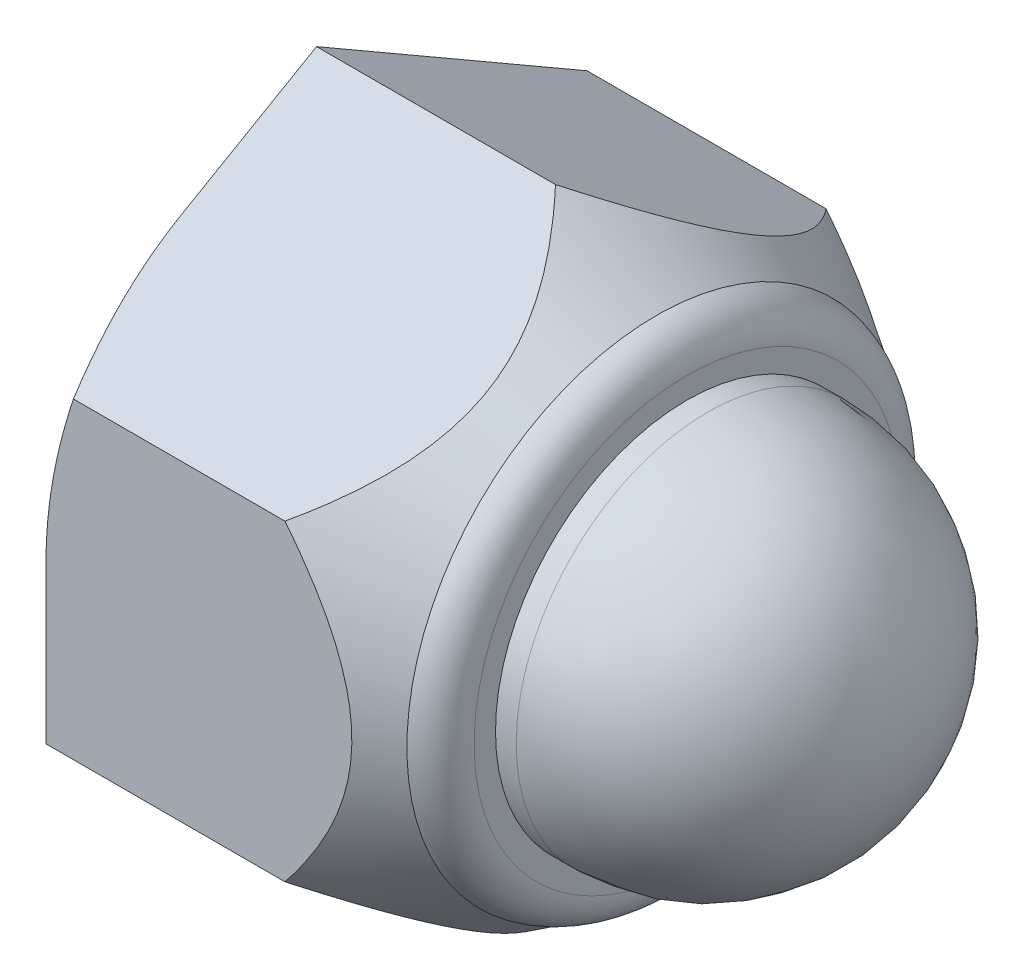
ISO-10303-21;
HEADER;
FILE_DESCRIPTION(('STEP AP214'),'2;1');
FILE_NAME('part.step','',(''),(''),'','','');
FILE_SCHEMA(('AUTOMOTIVE_DESIGN { 1 0 10303 214 1 1 1 1 }'));
ENDSEC;
DATA;
#1=APPLICATION_CONTEXT('core data for automotive mechanical design processes');
#2=APPLICATION_PROTOCOL_DEFINITION('international standard','automotive_design',2000,#1);
#3=PRODUCT_CONTEXT('',#1,'mechanical');
#4=PRODUCT('Part','Part','',(#3));
#5=PRODUCT_RELATED_PRODUCT_CATEGORY('part','',(#4));
#6=PRODUCT_DEFINITION_FORMATION('','',#4);
#7=PRODUCT_DEFINITION_CONTEXT('part definition',#1,'design');
#8=PRODUCT_DEFINITION('design','',#6,#7);
#9=PRODUCT_DEFINITION_SHAPE('','',#8);
#10=(LENGTH_UNIT() NAMED_UNIT(*) SI_UNIT(.MILLI.,.METRE.));
#11=(NAMED_UNIT(*) PLANE_ANGLE_UNIT() SI_UNIT($,.RADIAN.));
#12=(NAMED_UNIT(*) SI_UNIT($,.STERADIAN.) SOLID_ANGLE_UNIT());
#13=UNCERTAINTY_MEASURE_WITH_UNIT(LENGTH_MEASURE(1.E-05),#10,'distance_accuracy_value','');
#14=(GEOMETRIC_REPRESENTATION_CONTEXT(3) GLOBAL_UNCERTAINTY_ASSIGNED_CONTEXT((#13)) GLOBAL_UNIT_ASSIGNED_CONTEXT((#10,
#11,#12)) REPRESENTATION_CONTEXT('',''));
#15=CARTESIAN_POINT('',(0.,0.,0.));
#16=DIRECTION('',(0.,0.,1.));
#17=DIRECTION('',(1.,0.,0.));
#18=AXIS2_PLACEMENT_3D('',#15,#16,#17);
#19=CARTESIAN_POINT('',(8.9,0.,-4.85722139978605));
#20=DIRECTION('',(1.,0.,0.));
#21=DIRECTION('',(0.,1.,0.));
#22=AXIS2_PLACEMENT_3D('',#19,#20,#21);
#23=PLANE('',#22);
#24=CARTESIAN_POINT('',(8.9,0.,0.));
#25=DIRECTION('',(-1.,0.,0.));
#26=DIRECTION('',(0.,0.,-1.));
#27=AXIS2_PLACEMENT_3D('',#24,#25,#26);
#28=CIRCLE('',#27,5.11444279957211);
#29=CARTESIAN_POINT('',(8.9,0.,-5.11444279957211));
#30=VERTEX_POINT('',#29);
#31=EDGE_CURVE('E400',#30,#30,#28,.T.);
#32=ORIENTED_EDGE('',*,*,#31,.F.);
#33=EDGE_LOOP('',(#32));
#34=FACE_BOUND('',#33,.T.);
#35=CARTESIAN_POINT('',(8.9,0.,0.));
#36=DIRECTION('',(1.,0.,0.));
#37=DIRECTION('',(0.,1.,0.));
#38=AXIS2_PLACEMENT_3D('',#35,#36,#37);
#39=CIRCLE('',#38,4.6);
#40=CARTESIAN_POINT('',(8.9,4.6,0.));
#41=VERTEX_POINT('',#40);
#42=EDGE_CURVE('E406',#41,#41,#39,.T.);
#43=ORIENTED_EDGE('',*,*,#42,.F.);
#44=EDGE_LOOP('',(#43));
#45=FACE_BOUND('',#44,.T.);
#46=ADVANCED_FACE('F48',(#34,#45),#23,.T.);
#47=CARTESIAN_POINT('',(8.01,0.,0.));
#48=DIRECTION('',(-1.,0.,0.));
#49=DIRECTION('',(0.,0.,1.));
#50=AXIS2_PLACEMENT_3D('',#47,#48,#49);
#51=TOROIDAL_SURFACE('',#50,5.1144427995721,0.890000000000003);
#52=ORIENTED_EDGE('',*,*,#31,.T.);
#53=EDGE_LOOP('',(#52));
#54=FACE_BOUND('',#53,.T.);
#55=CARTESIAN_POINT('',(8.16226720166924,0.,0.));
#56=DIRECTION('',(-1.,0.,0.));
#57=DIRECTION('',(0.,0.,-1.));
#58=AXIS2_PLACEMENT_3D('',#55,#56,#57);
#59=CIRCLE('',#58,5.99132061273622);
#60=CARTESIAN_POINT('',(8.16226720166924,0.,-5.99132061273622));
#61=VERTEX_POINT('',#60);
#62=EDGE_CURVE('E395',#61,#61,#59,.T.);
#63=ORIENTED_EDGE('',*,*,#62,.F.);
#64=EDGE_LOOP('',(#63));
#65=FACE_BOUND('',#64,.T.);
#66=ADVANCED_FACE('F137',(#54,#65),#51,.T.);
#67=CARTESIAN_POINT('',(5.72686166566427,0.,0.));
#68=DIRECTION('',(-1.,0.,0.));
#69=DIRECTION('',(0.,0.,1.));
#70=AXIS2_PLACEMENT_3D('',#67,#68,#69);
#71=CONICAL_SURFACE('',#70,7.51463888542503,0.558950553682677);
#72=CARTESIAN_POINT('',(5.74138692919013,-7.50555349944406,-5.74396736265792E-11));
#73=CARTESIAN_POINT('',(5.80503511269938,-7.46573858681244,-0.0689614516211059));
#74=CARTESIAN_POINT('',(5.86776294303784,-7.42555670831236,-0.138558506721195));
#75=CARTESIAN_POINT('',(5.99113339646182,-7.34438447961661,-0.279152930981608));
#76=CARTESIAN_POINT('',(6.05177546344636,-7.3033939183262,-0.350150665768741));
#77=CARTESIAN_POINT('',(6.23066882152906,-7.17877209005956,-0.566002004060911));
#78=CARTESIAN_POINT('',(6.34533376945126,-7.0938329110153,-0.713120977717673));
#79=CARTESIAN_POINT('',(6.56468615724398,-6.91807199667602,-1.01754781133725));
#80=CARTESIAN_POINT('',(6.66908877374278,-6.82716059623753,-1.17501097588426));
#81=CARTESIAN_POINT('',(6.86064703230527,-6.64101430693525,-1.49742580659644));
#82=CARTESIAN_POINT('',(6.94783442883756,-6.54578778431164,-1.66236298200855));
#83=CARTESIAN_POINT('',(7.06937920683889,-6.39027037356851,-1.93172703887718));
#84=CARTESIAN_POINT('',(7.11086620550154,-6.33136813287741,-2.03374871243382));
#85=CARTESIAN_POINT('',(7.18480831677462,-6.21214242723166,-2.24025369218052));
#86=CARTESIAN_POINT('',(7.21726296304019,-6.15181888906905,-2.34473712517048));
#87=CARTESIAN_POINT('',(7.27182733123318,-6.03050187824934,-2.5548643517326));
#88=CARTESIAN_POINT('',(7.29401645150586,-5.96951741323026,-2.66049254361805));
#89=CARTESIAN_POINT('',(7.32757462149871,-5.84680438024642,-2.87303775149694));
#90=CARTESIAN_POINT('',(7.33894439004615,-5.78507586199182,-2.97995468138985));
#91=CARTESIAN_POINT('',(7.35042796061089,-5.66090801201987,-3.19501970620786));
#92=CARTESIAN_POINT('',(7.35046004194602,-5.59846676383281,-3.30317112055587));
#93=CARTESIAN_POINT('',(7.33906289651,-5.47384949671177,-3.51901455870989));
#94=CARTESIAN_POINT('',(7.32763350266091,-5.41167348165745,-3.62670657579614));
#95=CARTESIAN_POINT('',(7.29374878376323,-5.28790227893725,-3.84108458742144));
#96=CARTESIAN_POINT('',(7.27126219233375,-5.2263092461368,-3.94776684962406));
#97=CARTESIAN_POINT('',(7.21612593873974,-5.10425565765276,-4.15916986612452));
#98=CARTESIAN_POINT('',(7.18347000005225,-5.04379582588064,-4.26388936657091));
#99=CARTESIAN_POINT('',(7.04365287546157,-4.8192498633944,-4.65281438223152));
#100=CARTESIAN_POINT('',(6.90639594879058,-4.65973342508014,-4.92910495803425));
#101=CARTESIAN_POINT('',(6.66646189868466,-4.42983214379962,-5.32730565793729));
#102=CARTESIAN_POINT('',(6.58062248301389,-4.35463290095045,-5.45755456724276));
#103=CARTESIAN_POINT('',(6.39975212206151,-4.20703142677555,-5.71320781978576));
#104=CARTESIAN_POINT('',(6.30472372052305,-4.13462842910098,-5.8386134903784));
#105=CARTESIAN_POINT('',(6.13208645143806,-4.01022189501257,-6.05409192821309));
#106=CARTESIAN_POINT('',(6.05607898987833,-3.95765262168181,-6.14514458053894));
#107=CARTESIAN_POINT('',(5.90098174025237,-3.85412421304211,-6.32446104432965));
#108=CARTESIAN_POINT('',(5.82191179493555,-3.80315765827204,-6.41273770667815));
#109=CARTESIAN_POINT('',(5.74138692918675,-3.75277674976388,-6.49999999994577));
#110=B_SPLINE_CURVE_WITH_KNOTS('',3,(#72,#73,#74,#75,#76,#77,#78,#79,#80,#81,#82,#83,#84,#85,
#86,#87,#88,#89,#90,#91,#92,#93,#94,#95,#96,#97,#98,#99,#100,#101,#102,#103,#104,#105,#106,#107,
#108,#109),.UNSPECIFIED.,.F.,.F.,(4,2,2,2,2,2,2,2,2,2,2,2,2,2,2,2,2,2,4),(0.,0.305809959060088,
0.611700830146207,1.22611990276379,1.85445585555828,2.48162175099453,2.85600884109121,
3.23041525739561,3.60187532626783,3.97331071396854,4.34742330893957,4.72154135756062,
5.09672343468369,5.47213753474211,6.50714950484863,7.02654128390224,7.54578969159311,
7.93493295612241,8.32187743714851),.UNSPECIFIED.);
#111=CARTESIAN_POINT('',(5.74138692918693,-7.50555349943371,0.));
#112=VERTEX_POINT('',#111);
#113=CARTESIAN_POINT('',(5.74138692916181,-3.75277674974828,-6.49999999997279));
#114=VERTEX_POINT('',#113);
#115=EDGE_CURVE('E253',#112,#114,#110,.T.);
#116=ORIENTED_EDGE('',*,*,#115,.T.);
#117=CARTESIAN_POINT('',(5.74138692919013,-3.75277674967228,-6.50000000001046));
#118=CARTESIAN_POINT('',(5.80481935237871,-3.67341696365554,-6.50000000000386));
#119=CARTESIAN_POINT('',(5.86733767796993,-3.59332803253642,-6.50000000000106));
#120=CARTESIAN_POINT('',(5.99030375138624,-3.43154507830204,-6.49999999999894));
#121=CARTESIAN_POINT('',(6.05075096231494,-3.34985064750038,-6.49999999999963));
#122=CARTESIAN_POINT('',(6.22906862859786,-3.10151142946549,-6.50000000000074));
#123=CARTESIAN_POINT('',(6.34338103174896,-2.93227123400812,-6.5000000000002));
#124=CARTESIAN_POINT('',(6.5628921971135,-2.58088409970639,-6.4999999999998));
#125=CARTESIAN_POINT('',(6.66771997779659,-2.39850321052211,-6.49999999999995));
#126=CARTESIAN_POINT('',(6.86004345543974,-2.02501735896889,-6.50000000000005));
#127=CARTESIAN_POINT('',(6.9475685183248,-1.83392786711502,-6.49999999999998));
#128=CARTESIAN_POINT('',(7.07524564617501,-1.50719679960314,-6.50000000000001));
#129=CARTESIAN_POINT('',(7.12151655393195,-1.37394873937173,-6.50000000000007));
#130=CARTESIAN_POINT('',(7.20235019841837,-1.10389447370796,-6.49999999999993));
#131=CARTESIAN_POINT('',(7.23691282191349,-0.96708823387713,-6.49999999999975));
#132=CARTESIAN_POINT('',(7.29242705939251,-0.692587269939238,-6.50000000000025));
#133=CARTESIAN_POINT('',(7.31355203696645,-0.55492801195007,-6.50000000000093));
#134=CARTESIAN_POINT('',(7.34184510470665,-0.278177815809175,-6.49999999999907));
#135=CARTESIAN_POINT('',(7.34901508285866,-0.139087073884367,-6.49999999999652));
#136=CARTESIAN_POINT('',(7.34901665154125,0.134000233421512,-6.49999999999663));
#137=CARTESIAN_POINT('',(7.34236305035678,0.267997062199208,-6.4999999999991));
#138=CARTESIAN_POINT('',(7.31608621088364,0.534705516683043,-6.50000000000091));
#139=CARTESIAN_POINT('',(7.29646209084895,0.667417054391707,-6.50000000000024));
#140=CARTESIAN_POINT('',(7.24482742333799,0.932166505875289,-6.49999999999975));
#141=CARTESIAN_POINT('',(7.21265978677802,1.06417344851673,-6.49999999999993));
#142=CARTESIAN_POINT('',(7.13730401701897,1.32495282217261,-6.50000000000007));
#143=CARTESIAN_POINT('',(7.0941161483936,1.45372533075783,-6.50000000000002));
#144=CARTESIAN_POINT('',(6.9701651498273,1.78183154102149,-6.49999999999997));
#145=CARTESIAN_POINT('',(6.8821892885553,1.97844355163508,-6.49999999999999));
#146=CARTESIAN_POINT('',(6.68772608125454,2.36253865225656,-6.50000000000001));
#147=CARTESIAN_POINT('',(6.5812023633917,2.55000286129334,-6.5));
#148=CARTESIAN_POINT('',(6.35747423088523,2.91103160635691,-6.5));
#149=CARTESIAN_POINT('',(6.2406588908506,3.08483965794066,-6.5));
#150=CARTESIAN_POINT('',(6.05821432051882,3.33969234645971,-6.5));
#151=CARTESIAN_POINT('',(5.99634948837933,3.42347681644994,-6.5));
#152=CARTESIAN_POINT('',(5.8704381991993,3.58935458659689,-6.5));
#153=CARTESIAN_POINT('',(5.80639236235229,3.67144835704184,-6.5));
#154=CARTESIAN_POINT('',(5.7413869291861,3.75277674967076,-6.5));
#155=B_SPLINE_CURVE_WITH_KNOTS('',3,(#117,#118,#119,#120,#121,#122,#123,#124,#125,#126,#127,
#128,#129,#130,#131,#132,#133,#134,#135,#136,#137,#138,#139,#140,#141,#142,#143,#144,#145,#146,
#147,#148,#149,#150,#151,#152,#153,#154),.UNSPECIFIED.,.F.,.F.,(4,2,2,2,2,2,2,2,2,2,2,2,2,2,2,2,
2,2,4),(0.,0.304773467886984,0.609625353671449,1.22187410347659,1.85228633170506,
2.48161927035349,2.90433078410995,3.32704638592116,3.74419144682471,4.16128006783381,
4.56311447998876,4.96497621197116,5.37204123675957,5.77909648965125,6.42392701216271,
7.07003657110649,7.69780337503958,8.01022343779978,8.32255539026755),.UNSPECIFIED.);
#156=CARTESIAN_POINT('',(5.74138692916181,3.75277674970115,-6.5));
#157=VERTEX_POINT('',#156);
#158=EDGE_CURVE('E225',#114,#157,#155,.T.);
#159=ORIENTED_EDGE('',*,*,#158,.T.);
#160=CARTESIAN_POINT('',(5.74138692919013,3.75277674977177,-6.49999999995303));
#161=CARTESIAN_POINT('',(5.80503511269938,3.79259166239195,-6.43103854838275));
#162=CARTESIAN_POINT('',(5.86776294303784,3.83277354088717,-6.36144149327986));
#163=CARTESIAN_POINT('',(5.99113339646182,3.91394576957926,-6.22084706901733));
#164=CARTESIAN_POINT('',(6.05177546344636,3.95493633087086,-6.14984933423089));
#165=CARTESIAN_POINT('',(6.23066882152906,4.07955815913943,-5.93399799593983));
#166=CARTESIAN_POINT('',(6.34533376945126,4.16449733818275,-5.78687902228253));
#167=CARTESIAN_POINT('',(6.56468615724398,4.34025825252133,-5.48245218866254));
#168=CARTESIAN_POINT('',(6.66908877374278,4.43116965296008,-5.32498902411568));
#169=CARTESIAN_POINT('',(6.86064703230527,4.61731594226255,-5.00257419340361));
#170=CARTESIAN_POINT('',(6.94783442883755,4.71254246488608,-4.83763701799146));
#171=CARTESIAN_POINT('',(7.06937920683889,4.86805987562918,-4.56827296112281));
#172=CARTESIAN_POINT('',(7.11086620550154,4.92696211632029,-4.46625128756618));
#173=CARTESIAN_POINT('',(7.18480831677462,5.04618782196605,-4.25974630781948));
#174=CARTESIAN_POINT('',(7.21726296304019,5.10651136012865,-4.15526287482952));
#175=CARTESIAN_POINT('',(7.27182733123318,5.22782837094836,-3.9451356482674));
#176=CARTESIAN_POINT('',(7.29401645150586,5.28881283596744,-3.83950745638195));
#177=CARTESIAN_POINT('',(7.32757462149871,5.41152586895128,-3.62696224850306));
#178=CARTESIAN_POINT('',(7.33894439004615,5.47325438720588,-3.52004531861015));
#179=CARTESIAN_POINT('',(7.35042796061089,5.59742223717784,-3.30498029379214));
#180=CARTESIAN_POINT('',(7.35046004194602,5.6598634853649,-3.19682887944413));
#181=CARTESIAN_POINT('',(7.33906289651,5.78448075248594,-2.98098544129011));
#182=CARTESIAN_POINT('',(7.3276335026609,5.84665676754025,-2.87329342420386));
#183=CARTESIAN_POINT('',(7.29374878376322,5.97042797026046,-2.65891541257856));
#184=CARTESIAN_POINT('',(7.27126219233375,6.0320210030609,-2.55223315037594));
#185=CARTESIAN_POINT('',(7.21612593873974,6.15407459154494,-2.34083013387548));
#186=CARTESIAN_POINT('',(7.18347000005225,6.21453442331707,-2.23611063342909));
#187=CARTESIAN_POINT('',(7.04365287546158,6.4390803858033,-1.84718561776848));
#188=CARTESIAN_POINT('',(6.90639594879058,6.59859682411756,-1.57089504196575));
#189=CARTESIAN_POINT('',(6.66646189868466,6.82849810539808,-1.17269434206271));
#190=CARTESIAN_POINT('',(6.58062248301389,6.90369734824725,-1.04244543275724));
#191=CARTESIAN_POINT('',(6.3997521220615,7.05129882242215,-0.786792180214243));
#192=CARTESIAN_POINT('',(6.30472372052305,7.12370182009672,-0.6613865096216));
#193=CARTESIAN_POINT('',(6.13208645143806,7.24810835418513,-0.445908071786913));
#194=CARTESIAN_POINT('',(6.05607898987833,7.30067762751589,-0.354855419461063));
#195=CARTESIAN_POINT('',(5.90098174025237,7.40420603615559,-0.175538955670349));
#196=CARTESIAN_POINT('',(5.82191179493555,7.45517259092566,-0.0872622933218551));
#197=CARTESIAN_POINT('',(5.74138692918675,7.50555349943382,-5.42347271359171E-11));
#198=B_SPLINE_CURVE_WITH_KNOTS('',3,(#160,#161,#162,#163,#164,#165,#166,#167,#168,#169,#170,
#171,#172,#173,#174,#175,#176,#177,#178,#179,#180,#181,#182,#183,#184,#185,#186,#187,#188,#189,
#190,#191,#192,#193,#194,#195,#196,#197),.UNSPECIFIED.,.F.,.F.,(4,2,2,2,2,2,2,2,2,2,2,2,2,2,2,2,
2,2,4),(0.,0.305809959060089,0.611700830146208,1.2261199027638,1.85445585555828,
2.48162175099453,2.85600884109121,3.23041525739561,3.60187532626783,3.97331071396854,
4.34742330893957,4.72154135756062,5.09672343468369,5.47213753474211,6.50714950484863,
7.02654128390224,7.54578969159311,7.93493295612241,8.32187743714851),.UNSPECIFIED.);
#199=CARTESIAN_POINT('',(5.74138692918693,7.50555349943371,0.));
#200=VERTEX_POINT('',#199);
#201=EDGE_CURVE('E266',#157,#200,#198,.T.);
#202=ORIENTED_EDGE('',*,*,#201,.T.);
#203=CARTESIAN_POINT('',(5.74138692919013,7.50555349944406,5.74394788833589E-11));
#204=CARTESIAN_POINT('',(5.80503511269938,7.46573858681244,0.0689614516211056));
#205=CARTESIAN_POINT('',(5.86776294303784,7.42555670831236,0.138558506721195));
#206=CARTESIAN_POINT('',(5.99113339646182,7.34438447961661,0.279152930981608));
#207=CARTESIAN_POINT('',(6.05177546344636,7.3033939183262,0.350150665768741));
#208=CARTESIAN_POINT('',(6.23066882152906,7.17877209005956,0.566002004060911));
#209=CARTESIAN_POINT('',(6.34533376945126,7.0938329110153,0.713120977717673));
#210=CARTESIAN_POINT('',(6.56468615724398,6.91807199667602,1.01754781133725));
#211=CARTESIAN_POINT('',(6.66908877374279,6.82716059623753,1.17501097588426));
#212=CARTESIAN_POINT('',(6.86064703230527,6.64101430693525,1.49742580659644));
#213=CARTESIAN_POINT('',(6.94783442883756,6.54578778431164,1.66236298200855));
#214=CARTESIAN_POINT('',(7.06937920683889,6.39027037356851,1.93172703887718));
#215=CARTESIAN_POINT('',(7.11086620550154,6.33136813287741,2.03374871243382));
#216=CARTESIAN_POINT('',(7.18480831677462,6.21214242723166,2.24025369218052));
#217=CARTESIAN_POINT('',(7.21726296304019,6.15181888906905,2.34473712517048));
#218=CARTESIAN_POINT('',(7.27182733123318,6.03050187824934,2.5548643517326));
#219=CARTESIAN_POINT('',(7.29401645150586,5.96951741323026,2.66049254361805));
#220=CARTESIAN_POINT('',(7.32757462149871,5.84680438024642,2.87303775149694));
#221=CARTESIAN_POINT('',(7.33894439004615,5.78507586199182,2.97995468138985));
#222=CARTESIAN_POINT('',(7.35042796061089,5.66090801201987,3.19501970620786));
#223=CARTESIAN_POINT('',(7.35046004194602,5.59846676383281,3.30317112055587));
#224=CARTESIAN_POINT('',(7.33906289651,5.47384949671176,3.51901455870989));
#225=CARTESIAN_POINT('',(7.32763350266091,5.41167348165745,3.62670657579614));
#226=CARTESIAN_POINT('',(7.29374878376323,5.28790227893725,3.84108458742144));
#227=CARTESIAN_POINT('',(7.27126219233375,5.2263092461368,3.94776684962406));
#228=CARTESIAN_POINT('',(7.21612593873974,5.10425565765276,4.15916986612452));
#229=CARTESIAN_POINT('',(7.18347000005225,5.04379582588064,4.26388936657091));
#230=CARTESIAN_POINT('',(7.04365287546157,4.8192498633944,4.65281438223152));
#231=CARTESIAN_POINT('',(6.90639594879058,4.65973342508014,4.92910495803425));
#232=CARTESIAN_POINT('',(6.66646189868466,4.42983214379962,5.32730565793729));
#233=CARTESIAN_POINT('',(6.58062248301389,4.35463290095045,5.45755456724276));
#234=CARTESIAN_POINT('',(6.39975212206151,4.20703142677555,5.71320781978576));
#235=CARTESIAN_POINT('',(6.30472372052305,4.13462842910098,5.8386134903784));
#236=CARTESIAN_POINT('',(6.13208645143806,4.01022189501257,6.05409192821309));
#237=CARTESIAN_POINT('',(6.05607898987833,3.95765262168181,6.14514458053894));
#238=CARTESIAN_POINT('',(5.90098174025237,3.85412421304211,6.32446104432965));
#239=CARTESIAN_POINT('',(5.82191179493555,3.80315765827204,6.41273770667815));
#240=CARTESIAN_POINT('',(5.74138692918675,3.75277674976388,6.49999999994577));
#241=B_SPLINE_CURVE_WITH_KNOTS('',3,(#203,#204,#205,#206,#207,#208,#209,#210,#211,#212,#213,
#214,#215,#216,#217,#218,#219,#220,#221,#222,#223,#224,#225,#226,#227,#228,#229,#230,#231,#232,
#233,#234,#235,#236,#237,#238,#239,#240),.UNSPECIFIED.,.F.,.F.,(4,2,2,2,2,2,2,2,2,2,2,2,2,2,2,2,
2,2,4),(0.,0.305809959060088,0.611700830146207,1.22611990276379,1.85445585555828,
2.48162175099453,2.85600884109121,3.23041525739561,3.60187532626783,3.97331071396854,
4.34742330893957,4.72154135756062,5.09672343468369,5.47213753474211,6.50714950484863,
7.02654128390224,7.54578969159311,7.93493295612241,8.32187743714851),.UNSPECIFIED.);
#242=CARTESIAN_POINT('',(5.74138692918693,3.75277674971686,6.49999999997279));
#243=VERTEX_POINT('',#242);
#244=EDGE_CURVE('E213',#200,#243,#241,.T.);
#245=ORIENTED_EDGE('',*,*,#244,.T.);
#246=CARTESIAN_POINT('',(5.74138692919013,3.75277674967228,6.50000000001047));
#247=CARTESIAN_POINT('',(5.80481935237871,3.67341696365554,6.50000000000386));
#248=CARTESIAN_POINT('',(5.86733767796993,3.59332803253642,6.50000000000106));
#249=CARTESIAN_POINT('',(5.99030375138624,3.43154507830204,6.49999999999894));
#250=CARTESIAN_POINT('',(6.05075096231494,3.34985064750038,6.49999999999963));
#251=CARTESIAN_POINT('',(6.22906862859786,3.10151142946549,6.50000000000074));
#252=CARTESIAN_POINT('',(6.34338103174896,2.93227123400812,6.5000000000002));
#253=CARTESIAN_POINT('',(6.5628921971135,2.58088409970639,6.4999999999998));
#254=CARTESIAN_POINT('',(6.66771997779659,2.39850321052211,6.49999999999995));
#255=CARTESIAN_POINT('',(6.86004345543974,2.02501735896889,6.50000000000005));
#256=CARTESIAN_POINT('',(6.9475685183248,1.83392786711502,6.49999999999998));
#257=CARTESIAN_POINT('',(7.07524564617501,1.50719679960314,6.50000000000001));
#258=CARTESIAN_POINT('',(7.12151655393195,1.37394873937173,6.50000000000007));
#259=CARTESIAN_POINT('',(7.20235019841837,1.10389447370796,6.49999999999993));
#260=CARTESIAN_POINT('',(7.23691282191349,0.967088233877129,6.49999999999975));
#261=CARTESIAN_POINT('',(7.29242705939251,0.692587269939238,6.50000000000025));
#262=CARTESIAN_POINT('',(7.31355203696645,0.55492801195007,6.50000000000093));
#263=CARTESIAN_POINT('',(7.34184510470665,0.278177815809175,6.49999999999907));
#264=CARTESIAN_POINT('',(7.34901508285866,0.139087073884366,6.49999999999652));
#265=CARTESIAN_POINT('',(7.34901665154125,-0.134000233421512,6.49999999999663));
#266=CARTESIAN_POINT('',(7.34236305035678,-0.267997062199208,6.4999999999991));
#267=CARTESIAN_POINT('',(7.31608621088364,-0.534705516683043,6.50000000000091));
#268=CARTESIAN_POINT('',(7.29646209084895,-0.667417054391707,6.50000000000024));
#269=CARTESIAN_POINT('',(7.24482742333799,-0.932166505875289,6.49999999999975));
#270=CARTESIAN_POINT('',(7.21265978677802,-1.06417344851673,6.49999999999993));
#271=CARTESIAN_POINT('',(7.13730401701897,-1.32495282217261,6.50000000000007));
#272=CARTESIAN_POINT('',(7.0941161483936,-1.45372533075783,6.50000000000002));
#273=CARTESIAN_POINT('',(6.9701651498273,-1.78183154102149,6.49999999999997));
#274=CARTESIAN_POINT('',(6.8821892885553,-1.97844355163509,6.49999999999999));
#275=CARTESIAN_POINT('',(6.68772608125454,-2.36253865225656,6.50000000000001));
#276=CARTESIAN_POINT('',(6.5812023633917,-2.55000286129335,6.5));
#277=CARTESIAN_POINT('',(6.35747423088523,-2.91103160635691,6.5));
#278=CARTESIAN_POINT('',(6.2406588908506,-3.08483965794066,6.5));
#279=CARTESIAN_POINT('',(6.05821432051882,-3.33969234645971,6.5));
#280=CARTESIAN_POINT('',(5.99634948837933,-3.42347681644994,6.5));
#281=CARTESIAN_POINT('',(5.8704381991993,-3.58935458659689,6.5));
#282=CARTESIAN_POINT('',(5.80639236235229,-3.67144835704184,6.5));
#283=CARTESIAN_POINT('',(5.7413869291861,-3.75277674967076,6.5));
#284=B_SPLINE_CURVE_WITH_KNOTS('',3,(#246,#247,#248,#249,#250,#251,#252,#253,#254,#255,#256,
#257,#258,#259,#260,#261,#262,#263,#264,#265,#266,#267,#268,#269,#270,#271,#272,#273,#274,#275,
#276,#277,#278,#279,#280,#281,#282,#283),.UNSPECIFIED.,.F.,.F.,(4,2,2,2,2,2,2,2,2,2,2,2,2,2,2,2,
2,2,4),(0.,0.304773467886984,0.609625353671449,1.22187410347659,1.85228633170507,
2.48161927035349,2.90433078410995,3.32704638592116,3.74419144682471,4.16128006783381,
4.56311447998876,4.96497621197116,5.37204123675957,5.77909648965125,6.42392701216271,
7.07003657110649,7.69780337503958,8.01022343779978,8.32255539026755),.UNSPECIFIED.);
#285=CARTESIAN_POINT('',(5.74138692918693,-3.75277674971686,6.49999999997279));
#286=VERTEX_POINT('',#285);
#287=EDGE_CURVE('E232',#243,#286,#284,.T.);
#288=ORIENTED_EDGE('',*,*,#287,.T.);
#289=CARTESIAN_POINT('',(5.74138692919013,-3.75277674977177,6.49999999995303));
#290=CARTESIAN_POINT('',(5.80503511269938,-3.79259166239195,6.43103854838275));
#291=CARTESIAN_POINT('',(5.86776294303784,-3.83277354088717,6.36144149327986));
#292=CARTESIAN_POINT('',(5.99113339646182,-3.91394576957926,6.22084706901733));
#293=CARTESIAN_POINT('',(6.05177546344636,-3.95493633087086,6.14984933423089));
#294=CARTESIAN_POINT('',(6.23066882152906,-4.07955815913943,5.93399799593983));
#295=CARTESIAN_POINT('',(6.34533376945126,-4.16449733818275,5.78687902228253));
#296=CARTESIAN_POINT('',(6.56468615724398,-4.34025825252133,5.48245218866254));
#297=CARTESIAN_POINT('',(6.66908877374278,-4.43116965296008,5.32498902411568));
#298=CARTESIAN_POINT('',(6.86064703230527,-4.61731594226255,5.00257419340361));
#299=CARTESIAN_POINT('',(6.94783442883756,-4.71254246488608,4.83763701799146));
#300=CARTESIAN_POINT('',(7.06937920683889,-4.86805987562918,4.56827296112281));
#301=CARTESIAN_POINT('',(7.11086620550154,-4.92696211632029,4.46625128756618));
#302=CARTESIAN_POINT('',(7.18480831677462,-5.04618782196605,4.25974630781948));
#303=CARTESIAN_POINT('',(7.21726296304019,-5.10651136012865,4.15526287482952));
#304=CARTESIAN_POINT('',(7.27182733123318,-5.22782837094836,3.9451356482674));
#305=CARTESIAN_POINT('',(7.29401645150586,-5.28881283596744,3.83950745638195));
#306=CARTESIAN_POINT('',(7.32757462149871,-5.41152586895128,3.62696224850306));
#307=CARTESIAN_POINT('',(7.33894439004615,-5.47325438720588,3.52004531861015));
#308=CARTESIAN_POINT('',(7.35042796061089,-5.59742223717784,3.30498029379214));
#309=CARTESIAN_POINT('',(7.35046004194602,-5.6598634853649,3.19682887944413));
#310=CARTESIAN_POINT('',(7.33906289651,-5.78448075248594,2.98098544129011));
#311=CARTESIAN_POINT('',(7.3276335026609,-5.84665676754025,2.87329342420386));
#312=CARTESIAN_POINT('',(7.29374878376322,-5.97042797026046,2.65891541257856));
#313=CARTESIAN_POINT('',(7.27126219233375,-6.0320210030609,2.55223315037594));
#314=CARTESIAN_POINT('',(7.21612593873974,-6.15407459154494,2.34083013387548));
#315=CARTESIAN_POINT('',(7.18347000005225,-6.21453442331707,2.23611063342909));
#316=CARTESIAN_POINT('',(7.04365287546158,-6.4390803858033,1.84718561776848));
#317=CARTESIAN_POINT('',(6.90639594879058,-6.59859682411756,1.57089504196575));
#318=CARTESIAN_POINT('',(6.66646189868466,-6.82849810539808,1.17269434206271));
#319=CARTESIAN_POINT('',(6.58062248301389,-6.90369734824725,1.04244543275724));
#320=CARTESIAN_POINT('',(6.3997521220615,-7.05129882242215,0.786792180214242));
#321=CARTESIAN_POINT('',(6.30472372052305,-7.12370182009672,0.6613865096216));
#322=CARTESIAN_POINT('',(6.13208645143806,-7.24810835418513,0.445908071786913));
#323=CARTESIAN_POINT('',(6.05607898987833,-7.30067762751589,0.354855419461062));
#324=CARTESIAN_POINT('',(5.90098174025237,-7.40420603615559,0.175538955670349));
#325=CARTESIAN_POINT('',(5.82191179493555,-7.45517259092566,0.0872622933218551));
#326=CARTESIAN_POINT('',(5.74138692918675,-7.50555349943382,5.42345912819291E-11));
#327=B_SPLINE_CURVE_WITH_KNOTS('',3,(#289,#290,#291,#292,#293,#294,#295,#296,#297,#298,#299,
#300,#301,#302,#303,#304,#305,#306,#307,#308,#309,#310,#311,#312,#313,#314,#315,#316,#317,#318,
#319,#320,#321,#322,#323,#324,#325,#326),.UNSPECIFIED.,.F.,.F.,(4,2,2,2,2,2,2,2,2,2,2,2,2,2,2,2,
2,2,4),(0.,0.305809959060088,0.611700830146208,1.2261199027638,1.85445585555828,
2.48162175099453,2.85600884109121,3.23041525739561,3.60187532626783,3.97331071396854,
4.34742330893957,4.72154135756062,5.09672343468369,5.47213753474211,6.50714950484863,
7.02654128390224,7.54578969159312,7.93493295612241,8.32187743714851),.UNSPECIFIED.);
#328=EDGE_CURVE('E260',#286,#112,#327,.T.);
#329=ORIENTED_EDGE('',*,*,#328,.T.);
#330=EDGE_LOOP('',(#116,#159,#202,#245,#288,#329));
#331=FACE_BOUND('',#330,.T.);
#332=ORIENTED_EDGE('',*,*,#62,.T.);
#333=EDGE_LOOP('',(#332));
#334=FACE_BOUND('',#333,.T.);
#335=ADVANCED_FACE('F143',(#331,#334),#71,.T.);
#336=CARTESIAN_POINT('',(0.,-7.50555349946513,0.));
#337=DIRECTION('',(0.,0.866025403784439,0.5));
#338=DIRECTION('',(0.,-0.5,0.866025403784439));
#339=AXIS2_PLACEMENT_3D('',#336,#337,#338);
#340=PLANE('',#339);
#341=DIRECTION('',(1.,0.,0.));
#342=VECTOR('',#341,1.);
#343=CARTESIAN_POINT('',(0.,-3.75277674973257,-6.5));
#344=LINE('',#343,#342);
#345=CARTESIAN_POINT('',(0.658613075595392,-3.75277674231102,-6.50000001285449));
#346=VERTEX_POINT('',#345);
#347=EDGE_CURVE('E487',#346,#114,#344,.T.);
#348=ORIENTED_EDGE('',*,*,#347,.T.);
#349=ORIENTED_EDGE('',*,*,#115,.F.);
#350=DIRECTION('',(1.,0.,0.));
#351=VECTOR('',#350,1.);
#352=CARTESIAN_POINT('',(0.,-7.50555349946514,0.));
#353=LINE('',#352,#351);
#354=CARTESIAN_POINT('',(0.,-7.50555349946514,0.));
#355=VERTEX_POINT('',#354);
#356=EDGE_CURVE('E71',#112,#355,#353,.F.);
#357=ORIENTED_EDGE('',*,*,#356,.T.);
#358=DIRECTION('',(0.,-0.5,0.866025403784439));
#359=VECTOR('',#358,1.);
#360=CARTESIAN_POINT('',(0.,-7.50555349946513,0.));
#361=LINE('',#360,#359);
#362=CARTESIAN_POINT('',(0.,-5.62916512459885,-3.25));
#363=VERTEX_POINT('',#362);
#364=EDGE_CURVE('E311',#363,#355,#361,.T.);
#365=ORIENTED_EDGE('',*,*,#364,.F.);
#366=CARTESIAN_POINT('',(0.658613080456322,-3.75277673488948,-6.50000002570898));
#367=CARTESIAN_POINT('',(0.55919225497185,-3.90454907501542,-6.23712262142722));
#368=CARTESIAN_POINT('',(0.467823868970492,-4.05784639002424,-5.97160388316805));
#369=CARTESIAN_POINT('',(0.306462926467962,-4.36615407318476,-5.4375993115702));
#370=CARTESIAN_POINT('',(0.236337315868095,-4.52114720033179,-5.16914334052756));
#371=CARTESIAN_POINT('',(0.150040636154996,-4.75551517533543,-4.76320610015422));
#372=CARTESIAN_POINT('',(0.124410024701669,-4.83401813667345,-4.62723498257215));
#373=CARTESIAN_POINT('',(0.0800006439183522,-4.9915078453401,-4.35445480549229));
#374=CARTESIAN_POINT('',(0.0612216067795827,-5.0704945736369,-4.2176457789586));
#375=CARTESIAN_POINT('',(0.0308584365832581,-5.22932301109563,-3.94254685559329));
#376=CARTESIAN_POINT('',(0.0193208302085153,-5.3091669628034,-3.80425307455837));
#377=CARTESIAN_POINT('',(0.00387388894455526,-5.46906048316512,-3.52730937349082));
#378=CARTESIAN_POINT('',(-3.33229397973804E-05,-5.54911010284062,-3.38865936508629));
#379=CARTESIAN_POINT('',(0.,-5.62916512459885,-3.25));
#380=B_SPLINE_CURVE_WITH_KNOTS('',3,(#366,#367,#368,#369,#370,#371,#372,#373,#374,#375,#376,
#377,#378,#379),.UNSPECIFIED.,.F.,.F.,(4,2,2,2,2,2,4),(0.,0.958749328898137,1.91136307778318,
2.38847845754827,2.865575186216,3.34570673067401,3.82597184312311),.UNSPECIFIED.);
#381=EDGE_CURVE('E192',#346,#363,#380,.T.);
#382=ORIENTED_EDGE('',*,*,#381,.F.);
#383=EDGE_LOOP('',(#348,#349,#357,#365,#382));
#384=FACE_BOUND('',#383,.T.);
#385=ADVANCED_FACE('F242',(#384),#340,.F.);
#386=CARTESIAN_POINT('',(0.,-3.75277674973257,6.5));
#387=DIRECTION('',(0.,0.866025403784439,-0.5));
#388=DIRECTION('',(0.,0.5,0.866025403784439));
#389=AXIS2_PLACEMENT_3D('',#386,#387,#388);
#390=PLANE('',#389);
#391=ORIENTED_EDGE('',*,*,#356,.F.);
#392=ORIENTED_EDGE('',*,*,#328,.F.);
#393=DIRECTION('',(-1.,0.,0.));
#394=VECTOR('',#393,1.);
#395=CARTESIAN_POINT('',(0.,-3.75277674973257,6.5));
#396=LINE('',#395,#394);
#397=CARTESIAN_POINT('',(0.,-3.75277674973257,6.5));
#398=VERTEX_POINT('',#397);
#399=EDGE_CURVE('E63',#286,#398,#396,.T.);
#400=ORIENTED_EDGE('',*,*,#399,.T.);
#401=DIRECTION('',(0.,-0.5,-0.866025403784439));
#402=VECTOR('',#401,1.);
#403=CARTESIAN_POINT('',(0.,-7.902481809533,-0.6875));
#404=LINE('',#403,#402);
#405=EDGE_CURVE('E314',#398,#355,#404,.T.);
#406=ORIENTED_EDGE('',*,*,#405,.T.);
#407=EDGE_LOOP('',(#391,#392,#400,#406));
#408=FACE_BOUND('',#407,.T.);
#409=ADVANCED_FACE('F378',(#408),#390,.F.);
#410=CARTESIAN_POINT('',(0.,3.75277674973257,6.5));
#411=DIRECTION('',(0.,0.,-1.));
#412=DIRECTION('',(-1.,0.,0.));
#413=AXIS2_PLACEMENT_3D('',#410,#411,#412);
#414=PLANE('',#413);
#415=ORIENTED_EDGE('',*,*,#399,.F.);
#416=ORIENTED_EDGE('',*,*,#287,.F.);
#417=DIRECTION('',(1.,0.,0.));
#418=VECTOR('',#417,1.);
#419=CARTESIAN_POINT('',(0.,3.75277674973257,6.5));
#420=LINE('',#419,#418);
#421=CARTESIAN_POINT('',(0.658613057031033,3.75277677065461,6.49999996376196));
#422=VERTEX_POINT('',#421);
#423=EDGE_CURVE('E224',#243,#422,#420,.F.);
#424=ORIENTED_EDGE('',*,*,#423,.T.);
#425=CARTESIAN_POINT('',(0.,0.,6.5));
#426=CARTESIAN_POINT('',(-3.33229397965863E-05,0.160110043516462,6.5));
#427=CARTESIAN_POINT('',(0.00387388894455625,0.320209282867469,6.5));
#428=CARTESIAN_POINT('',(0.0193208302085165,0.639996323590909,6.5));
#429=CARTESIAN_POINT('',(0.0308584365832595,0.799684227006436,6.5));
#430=CARTESIAN_POINT('',(0.0612216067795837,1.1173411019239,6.5));
#431=CARTESIAN_POINT('',(0.0800006439183528,1.2753145585175,6.5));
#432=CARTESIAN_POINT('',(0.124410024701669,1.5902939758508,6.5));
#433=CARTESIAN_POINT('',(0.150040636154996,1.74729989852685,6.5));
#434=CARTESIAN_POINT('',(0.236337315868095,2.21603584853412,6.5));
#435=CARTESIAN_POINT('',(0.306462926467962,2.52602210282819,6.5));
#436=CARTESIAN_POINT('',(0.467823868970491,3.14263746914921,6.5));
#437=CARTESIAN_POINT('',(0.559192254971848,3.44923209916685,6.5));
#438=CARTESIAN_POINT('',(0.65861308045632,3.75277677941873,6.5));
#439=B_SPLINE_CURVE_WITH_KNOTS('',3,(#425,#426,#427,#428,#429,#430,#431,#432,#433,#434,#435,
#436,#437,#438),.UNSPECIFIED.,.F.,.F.,(4,2,2,2,2,2,4),(0.,0.480265112449095,0.960396656907107,
1.43749338557483,1.91460876533993,2.86722251422496,3.8259718431231),.UNSPECIFIED.);
#440=CARTESIAN_POINT('',(0.,0.,6.5));
#441=VERTEX_POINT('',#440);
#442=EDGE_CURVE('E173',#441,#422,#439,.T.);
#443=ORIENTED_EDGE('',*,*,#442,.F.);
#444=DIRECTION('',(0.,-1.,0.));
#445=VECTOR('',#444,1.);
#446=CARTESIAN_POINT('',(0.,0.,6.5));
#447=LINE('',#446,#445);
#448=EDGE_CURVE('E485',#441,#398,#447,.T.);
#449=ORIENTED_EDGE('',*,*,#448,.T.);
#450=EDGE_LOOP('',(#415,#416,#424,#443,#449));
#451=FACE_BOUND('',#450,.T.);
#452=ADVANCED_FACE('F206',(#451),#414,.F.);
#453=CARTESIAN_POINT('',(0.,7.50555349946513,0.));
#454=DIRECTION('',(0.,-0.866025403784439,-0.5));
#455=DIRECTION('',(0.,0.5,-0.866025403784439));
#456=AXIS2_PLACEMENT_3D('',#453,#454,#455);
#457=PLANE('',#456);
#458=CARTESIAN_POINT('',(0.658613043327605,3.75277679157665,6.49999992752392));
#459=CARTESIAN_POINT('',(0.559192222965652,3.90454912730033,6.23712253086711));
#460=CARTESIAN_POINT('',(0.467823841873484,4.05784643782121,5.97160380038128));
#461=CARTESIAN_POINT('',(0.306462908269822,4.36615411189624,5.43759924451995));
#462=CARTESIAN_POINT('',(0.236337301670803,4.52114723444761,5.16914328143722));
#463=CARTESIAN_POINT('',(0.150040627008833,4.75551520240174,4.76320605327398));
#464=CARTESIAN_POINT('',(0.124410017082975,4.8340181613558,4.62723493982107));
#465=CARTESIAN_POINT('',(0.0800006389729852,4.99150786521355,4.35445477107047));
#466=CARTESIAN_POINT('',(0.0612216029801342,5.07049459108543,4.21764574873686));
#467=CARTESIAN_POINT('',(0.0308584346536583,5.22932302362591,3.94254683389023));
#468=CARTESIAN_POINT('',(0.0193208289981344,5.30916697284004,3.8042530571744));
#469=CARTESIAN_POINT('',(0.00387388870121653,5.46906048819407,3.52730936478042));
#470=CARTESIAN_POINT('',(-3.332293570279E-05,5.54911010535551,3.38865936073038));
#471=CARTESIAN_POINT('',(0.,5.62916512459885,3.25));
#472=B_SPLINE_CURVE_WITH_KNOTS('',3,(#458,#459,#460,#461,#462,#463,#464,#465,#466,#467,#468,
#469,#470,#471),.UNSPECIFIED.,.F.,.F.,(4,2,2,2,2,2,4),(0.,0.958749298954061,1.91136301834702,
2.38847838326811,2.86557509709564,3.34570662649194,3.82597172385888),.UNSPECIFIED.);
#473=CARTESIAN_POINT('',(0.,5.62916512459885,3.25));
#474=VERTEX_POINT('',#473);
#475=EDGE_CURVE('E182',#422,#474,#472,.T.);
#476=ORIENTED_EDGE('',*,*,#475,.F.);
#477=ORIENTED_EDGE('',*,*,#423,.F.);
#478=ORIENTED_EDGE('',*,*,#244,.F.);
#479=DIRECTION('',(1.,0.,0.));
#480=VECTOR('',#479,1.);
#481=CARTESIAN_POINT('',(0.,7.50555349946514,0.));
#482=LINE('',#481,#480);
#483=CARTESIAN_POINT('',(0.,7.50555349946514,0.));
#484=VERTEX_POINT('',#483);
#485=EDGE_CURVE('E273',#200,#484,#482,.F.);
#486=ORIENTED_EDGE('',*,*,#485,.T.);
#487=DIRECTION('',(0.,0.5,-0.866025403784439));
#488=VECTOR('',#487,1.);
#489=CARTESIAN_POINT('',(0.,7.50555349946513,0.));
#490=LINE('',#489,#488);
#491=EDGE_CURVE('E300',#474,#484,#490,.T.);
#492=ORIENTED_EDGE('',*,*,#491,.F.);
#493=EDGE_LOOP('',(#476,#477,#478,#486,#492));
#494=FACE_BOUND('',#493,.T.);
#495=ADVANCED_FACE('F201',(#494),#457,.F.);
#496=CARTESIAN_POINT('',(0.,-3.75277674973257,-6.5));
#497=DIRECTION('',(0.,0.,1.));
#498=DIRECTION('',(1.,0.,0.));
#499=AXIS2_PLACEMENT_3D('',#496,#497,#498);
#500=PLANE('',#499);
#501=DIRECTION('',(1.,0.,0.));
#502=VECTOR('',#501,1.);
#503=CARTESIAN_POINT('',(0.,3.75277674973257,-6.5));
#504=LINE('',#503,#502);
#505=CARTESIAN_POINT('',(0.,3.75277674973257,-6.5));
#506=VERTEX_POINT('',#505);
#507=EDGE_CURVE('E274',#506,#157,#504,.T.);
#508=ORIENTED_EDGE('',*,*,#507,.T.);
#509=ORIENTED_EDGE('',*,*,#158,.F.);
#510=ORIENTED_EDGE('',*,*,#347,.F.);
#511=CARTESIAN_POINT('',(0.,0.,-6.5));
#512=CARTESIAN_POINT('',(-3.33229357019818E-05,-0.160110038486688,-6.5));
#513=CARTESIAN_POINT('',(0.0038738887012174,-0.320209272809561,-6.5));
#514=CARTESIAN_POINT('',(0.0193208289981353,-0.639996303517625,-6.5));
#515=CARTESIAN_POINT('',(0.0308584346536591,-0.799684201945888,-6.5));
#516=CARTESIAN_POINT('',(0.0612216029801346,-1.11734106702684,-6.5));
#517=CARTESIAN_POINT('',(0.0800006389729852,-1.2753145187706,-6.5));
#518=CARTESIAN_POINT('',(0.124410017082975,-1.5902939264861,-6.5));
#519=CARTESIAN_POINT('',(0.150040627008832,-1.7472998443942,-6.5));
#520=CARTESIAN_POINT('',(0.236337301670801,-2.21603578030247,-6.5));
#521=CARTESIAN_POINT('',(0.30646290826982,-2.52602202540522,-6.5));
#522=CARTESIAN_POINT('',(0.46782384187348,-3.14263737355527,-6.5));
#523=CARTESIAN_POINT('',(0.559192222965647,-3.44923199459703,-6.5));
#524=CARTESIAN_POINT('',(0.658613043327599,-3.75277666604438,-6.5));
#525=B_SPLINE_CURVE_WITH_KNOTS('',3,(#511,#512,#513,#514,#515,#516,#517,#518,#519,#520,#521,
#522,#523,#524),.UNSPECIFIED.,.F.,.F.,(4,2,2,2,2,2,4),(0.,0.480265097366934,0.960396626763236,
1.43749334059076,1.91460870551185,2.8672224249048,3.82597172385886),.UNSPECIFIED.);
#526=CARTESIAN_POINT('',(0.,0.,-6.5));
#527=VERTEX_POINT('',#526);
#528=EDGE_CURVE('E275',#527,#346,#525,.T.);
#529=ORIENTED_EDGE('',*,*,#528,.F.);
#530=DIRECTION('',(0.,1.,0.));
#531=VECTOR('',#530,1.);
#532=CARTESIAN_POINT('',(0.,0.,-6.5));
#533=LINE('',#532,#531);
#534=EDGE_CURVE('E301',#527,#506,#533,.T.);
#535=ORIENTED_EDGE('',*,*,#534,.T.);
#536=EDGE_LOOP('',(#508,#509,#510,#529,#535));
#537=FACE_BOUND('',#536,.T.);
#538=ADVANCED_FACE('F205',(#537),#500,.F.);
#539=CARTESIAN_POINT('',(0.,3.75277674973257,-6.5));
#540=DIRECTION('',(0.,-0.866025403784439,0.5));
#541=DIRECTION('',(0.,-0.5,-0.866025403784439));
#542=AXIS2_PLACEMENT_3D('',#539,#540,#541);
#543=PLANE('',#542);
#544=DIRECTION('',(0.,-0.5,-0.866025403784439));
#545=VECTOR('',#544,1.);
#546=CARTESIAN_POINT('',(0.,3.75277674973257,-6.5));
#547=LINE('',#546,#545);
#548=EDGE_CURVE('E294',#484,#506,#547,.T.);
#549=ORIENTED_EDGE('',*,*,#548,.F.);
#550=ORIENTED_EDGE('',*,*,#485,.F.);
#551=ORIENTED_EDGE('',*,*,#201,.F.);
#552=ORIENTED_EDGE('',*,*,#507,.F.);
#553=EDGE_LOOP('',(#549,#550,#551,#552));
#554=FACE_BOUND('',#553,.T.);
#555=ADVANCED_FACE('F282',(#554),#543,.F.);
#556=CARTESIAN_POINT('',(0.662564749158868,0.,0.));
#557=DIRECTION('',(1.,0.,0.));
#558=DIRECTION('',(0.,0.,-1.));
#559=AXIS2_PLACEMENT_3D('',#556,#557,#558);
#560=CONICAL_SURFACE('',#559,7.51158682046192,0.990931224568671);
#561=ORIENTED_EDGE('',*,*,#381,.T.);
#562=CARTESIAN_POINT('',(0.,0.,0.));
#563=DIRECTION('',(1.,0.,0.));
#564=DIRECTION('',(0.,0.,-1.));
#565=AXIS2_PLACEMENT_3D('',#562,#563,#564);
#566=CIRCLE('',#565,6.5);
#567=EDGE_CURVE('E473',#527,#363,#566,.F.);
#568=ORIENTED_EDGE('',*,*,#567,.F.);
#569=ORIENTED_EDGE('',*,*,#528,.T.);
#570=EDGE_LOOP('',(#561,#568,#569));
#571=FACE_BOUND('',#570,.T.);
#572=ADVANCED_FACE('F160',(#571),#560,.T.);
#573=CARTESIAN_POINT('',(0.662564749158868,0.,0.));
#574=DIRECTION('',(1.,0.,0.));
#575=DIRECTION('',(0.,0.,-1.));
#576=AXIS2_PLACEMENT_3D('',#573,#574,#575);
#577=CONICAL_SURFACE('',#576,7.51158682046192,0.990931224568671);
#578=CARTESIAN_POINT('',(0.,0.,0.));
#579=DIRECTION('',(1.,0.,0.));
#580=DIRECTION('',(0.,0.,-1.));
#581=AXIS2_PLACEMENT_3D('',#578,#579,#580);
#582=CIRCLE('',#581,6.5);
#583=EDGE_CURVE('E310',#441,#474,#582,.F.);
#584=ORIENTED_EDGE('',*,*,#583,.F.);
#585=ORIENTED_EDGE('',*,*,#442,.T.);
#586=ORIENTED_EDGE('',*,*,#475,.T.);
#587=EDGE_LOOP('',(#584,#585,#586));
#588=FACE_BOUND('',#587,.T.);
#589=ADVANCED_FACE('F151',(#588),#577,.T.);
#590=CARTESIAN_POINT('',(0.,0.,-5.25));
#591=DIRECTION('',(-1.,0.,0.));
#592=DIRECTION('',(0.,0.,1.));
#593=AXIS2_PLACEMENT_3D('',#590,#591,#592);
#594=PLANE('',#593);
#595=CARTESIAN_POINT('',(0.,0.,0.));
#596=DIRECTION('',(-1.,0.,0.));
#597=DIRECTION('',(0.,0.,1.));
#598=AXIS2_PLACEMENT_3D('',#595,#596,#597);
#599=CIRCLE('',#598,4.00000000001796);
#600=CARTESIAN_POINT('',(0.,0.,4.00000000001796));
#601=VERTEX_POINT('',#600);
#602=EDGE_CURVE('E56',#601,#601,#599,.F.);
#603=ORIENTED_EDGE('',*,*,#602,.T.);
#604=EDGE_LOOP('',(#603));
#605=FACE_BOUND('',#604,.T.);
#606=ORIENTED_EDGE('',*,*,#583,.T.);
#607=ORIENTED_EDGE('',*,*,#491,.T.);
#608=ORIENTED_EDGE('',*,*,#548,.T.);
#609=ORIENTED_EDGE('',*,*,#534,.F.);
#610=ORIENTED_EDGE('',*,*,#567,.T.);
#611=ORIENTED_EDGE('',*,*,#364,.T.);
#612=ORIENTED_EDGE('',*,*,#405,.F.);
#613=ORIENTED_EDGE('',*,*,#448,.F.);
#614=EDGE_LOOP('',(#606,#607,#608,#609,#610,#611,#612,#613));
#615=FACE_BOUND('',#614,.T.);
#616=ADVANCED_FACE('F139',(#605,#615),#594,.T.);
#617=CARTESIAN_POINT('',(9.4,0.,0.));
#618=DIRECTION('',(0.350205385371438,0.567234925176699,0.745386294290837));
#619=DIRECTION('',(-0.921753156730148,0.0672326195429036,0.381904298126384));
#620=AXIS2_PLACEMENT_3D('',#617,#618,#619);
#621=SPHERICAL_SURFACE('',#620,4.6);
#622=CARTESIAN_POINT('',(11.0109447727086,2.60928065581282,3.42877695373785));
#623=VERTEX_POINT('',#622);
#624=VERTEX_LOOP('',#623);
#625=FACE_BOUND('',#624,.T.);
#626=CARTESIAN_POINT('',(9.4,0.,0.));
#627=DIRECTION('',(-1.,0.,0.));
#628=DIRECTION('',(0.,0.,1.));
#629=AXIS2_PLACEMENT_3D('',#626,#627,#628);
#630=CIRCLE('',#629,4.6);
#631=CARTESIAN_POINT('',(9.4,0.,4.6));
#632=VERTEX_POINT('',#631);
#633=EDGE_CURVE('E541',#632,#632,#630,.T.);
#634=ORIENTED_EDGE('',*,*,#633,.F.);
#635=EDGE_LOOP('',(#634));
#636=FACE_BOUND('',#635,.T.);
#637=ADVANCED_FACE('F146',(#625,#636),#621,.T.);
#638=CARTESIAN_POINT('',(19.9240645861678,0.,0.));
#639=DIRECTION('',(-1.,0.,0.));
#640=DIRECTION('',(0.,-1.,0.));
#641=AXIS2_PLACEMENT_3D('',#638,#639,#640);
#642=CYLINDRICAL_SURFACE('',#641,4.6);
#643=ORIENTED_EDGE('',*,*,#633,.T.);
#644=EDGE_LOOP('',(#643));
#645=FACE_BOUND('',#644,.T.);
#646=ORIENTED_EDGE('',*,*,#42,.T.);
#647=EDGE_LOOP('',(#646));
#648=FACE_BOUND('',#647,.T.);
#649=ADVANCED_FACE('F132',(#645,#648),#642,.T.);
#650=CARTESIAN_POINT('',(0.,0.,0.));
#651=DIRECTION('',(1.,0.,0.));
#652=DIRECTION('',(0.,1.,0.));
#653=AXIS2_PLACEMENT_3D('',#650,#651,#652);
#654=CYLINDRICAL_SURFACE('',#653,3.3235000000142);
#655=CARTESIAN_POINT('',(0.478357737477749,0.,0.));
#656=DIRECTION('',(-1.,0.,0.));
#657=DIRECTION('',(0.,-1.,0.));
#658=AXIS2_PLACEMENT_3D('',#655,#656,#657);
#659=CIRCLE('',#658,3.3235000000142);
#660=CARTESIAN_POINT('',(0.478357737477749,-3.3235000000142,0.));
#661=VERTEX_POINT('',#660);
#662=EDGE_CURVE('E13',#661,#661,#659,.T.);
#663=ORIENTED_EDGE('',*,*,#662,.T.);
#664=EDGE_LOOP('',(#663));
#665=FACE_BOUND('',#664,.T.);
#666=CARTESIAN_POINT('',(8.4216422625273,0.,0.));
#667=DIRECTION('',(1.,0.,0.));
#668=DIRECTION('',(0.,1.,0.));
#669=AXIS2_PLACEMENT_3D('',#666,#667,#668);
#670=CIRCLE('',#669,3.3235000000142);
#671=CARTESIAN_POINT('',(8.4216422625273,3.3235000000142,0.));
#672=VERTEX_POINT('',#671);
#673=EDGE_CURVE('E532',#672,#672,#670,.T.);
#674=ORIENTED_EDGE('',*,*,#673,.T.);
#675=EDGE_LOOP('',(#674));
#676=FACE_BOUND('',#675,.T.);
#677=ADVANCED_FACE('F122',(#665,#676),#654,.F.);
#678=CARTESIAN_POINT('',(12.1500000000765,0.,0.));
#679=DIRECTION('',(-1.,0.,0.));
#680=DIRECTION('',(0.,-1.,0.));
#681=AXIS2_PLACEMENT_3D('',#678,#679,#680);
#682=CONICAL_SURFACE('',#681,0.,1.03776221660322);
#683=CARTESIAN_POINT('',(9.79,0.,0.));
#684=DIRECTION('',(1.,0.,0.));
#685=DIRECTION('',(0.,1.,0.));
#686=AXIS2_PLACEMENT_3D('',#683,#684,#685);
#687=CIRCLE('',#686,4.);
#688=CARTESIAN_POINT('',(9.79,4.,0.));
#689=VERTEX_POINT('',#688);
#690=EDGE_CURVE('E536',#689,#689,#687,.T.);
#691=ORIENTED_EDGE('',*,*,#690,.F.);
#692=EDGE_LOOP('',(#691));
#693=FACE_BOUND('',#692,.T.);
#694=CARTESIAN_POINT('',(12.1500000000765,0.,0.));
#695=VERTEX_POINT('',#694);
#696=VERTEX_LOOP('',#695);
#697=FACE_BOUND('',#696,.T.);
#698=ADVANCED_FACE('F119',(#693,#697),#682,.F.);
#699=CARTESIAN_POINT('',(0.,0.,0.));
#700=DIRECTION('',(1.,0.,0.));
#701=DIRECTION('',(0.,1.,0.));
#702=AXIS2_PLACEMENT_3D('',#699,#700,#701);
#703=CYLINDRICAL_SURFACE('',#702,4.);
#704=CARTESIAN_POINT('',(8.89999999998281,0.,0.));
#705=DIRECTION('',(1.,0.,0.));
#706=DIRECTION('',(0.,1.,0.));
#707=AXIS2_PLACEMENT_3D('',#704,#705,#706);
#708=CIRCLE('',#707,4.);
#709=CARTESIAN_POINT('',(8.89999999998281,4.,0.));
#710=VERTEX_POINT('',#709);
#711=EDGE_CURVE('E533',#710,#710,#708,.T.);
#712=ORIENTED_EDGE('',*,*,#711,.F.);
#713=EDGE_LOOP('',(#712));
#714=FACE_BOUND('',#713,.T.);
#715=ORIENTED_EDGE('',*,*,#690,.T.);
#716=EDGE_LOOP('',(#715));
#717=FACE_BOUND('',#716,.T.);
#718=ADVANCED_FACE('F121',(#714,#717),#703,.F.);
#719=CARTESIAN_POINT('',(8.89999999998281,0.,0.));
#720=DIRECTION('',(1.,0.,0.));
#721=DIRECTION('',(0.,1.,0.));
#722=AXIS2_PLACEMENT_3D('',#719,#720,#721);
#723=CONICAL_SURFACE('',#722,4.,0.955316618131556);
#724=ORIENTED_EDGE('',*,*,#673,.F.);
#725=EDGE_LOOP('',(#724));
#726=FACE_BOUND('',#725,.T.);
#727=ORIENTED_EDGE('',*,*,#711,.T.);
#728=EDGE_LOOP('',(#727));
#729=FACE_BOUND('',#728,.T.);
#730=ADVANCED_FACE('F129',(#726,#729),#723,.F.);
#731=CARTESIAN_POINT('',(0.,0.,0.));
#732=DIRECTION('',(-1.,0.,0.));
#733=DIRECTION('',(0.,-1.,0.));
#734=AXIS2_PLACEMENT_3D('',#731,#732,#733);
#735=CONICAL_SURFACE('',#734,4.00000000001796,0.955316618122153);
#736=ORIENTED_EDGE('',*,*,#662,.F.);
#737=EDGE_LOOP('',(#736));
#738=FACE_BOUND('',#737,.T.);
#739=ORIENTED_EDGE('',*,*,#602,.F.);
#740=EDGE_LOOP('',(#739));
#741=FACE_BOUND('',#740,.T.);
#742=ADVANCED_FACE('F50',(#738,#741),#735,.F.);
#743=CLOSED_SHELL('',(#46,#66,#335,#385,#409,#452,#495,#538,#555,#572,#589,#616,#637,#649,#677,
#698,#718,#730,#742));
#744=MANIFOLD_SOLID_BREP('B2',#743);
#745=ADVANCED_BREP_SHAPE_REPRESENTATION('',(#18,#744),#14);
#746=SHAPE_DEFINITION_REPRESENTATION(#9,#745);
ENDSEC;
END-ISO-10303-21;
